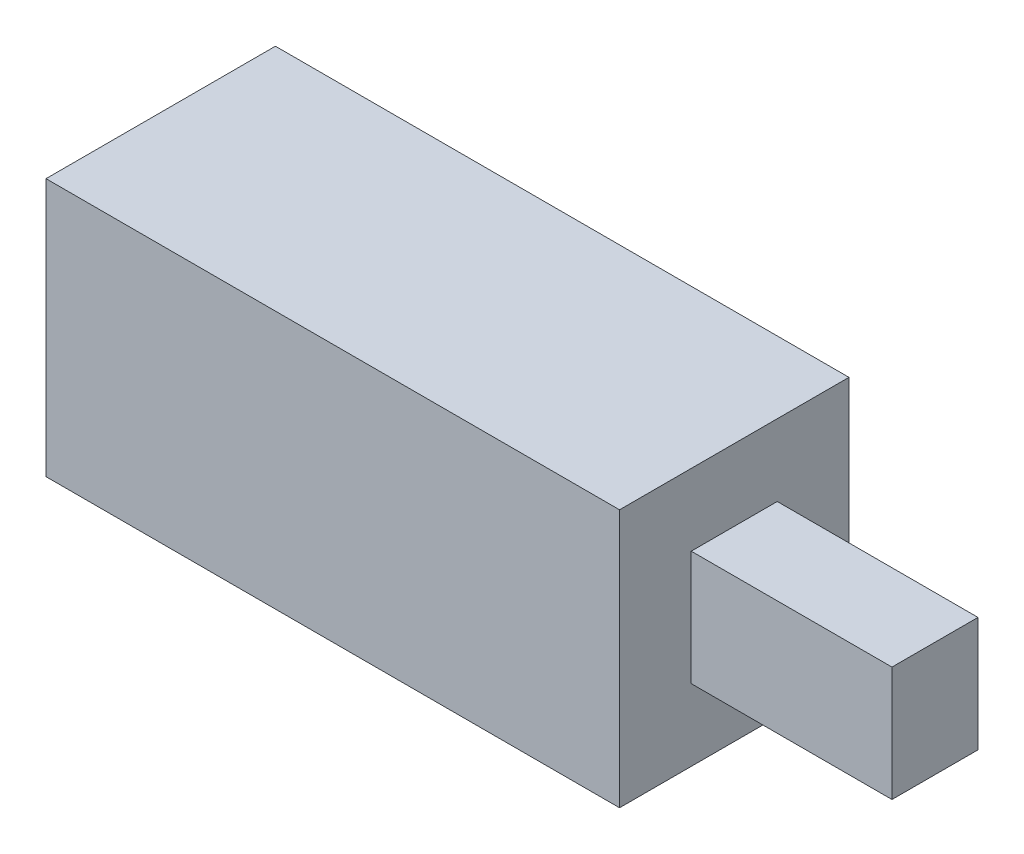
ISO-10303-21;
HEADER;
FILE_DESCRIPTION(('STEP AP214'),'2;1');
FILE_NAME('part.step','',(''),(''),'','','');
FILE_SCHEMA(('AUTOMOTIVE_DESIGN { 1 0 10303 214 1 1 1 1 }'));
ENDSEC;
DATA;
#1=APPLICATION_CONTEXT('core data for automotive mechanical design processes');
#2=APPLICATION_PROTOCOL_DEFINITION('international standard','automotive_design',2000,#1);
#3=PRODUCT_CONTEXT('',#1,'mechanical');
#4=PRODUCT('Part','Part','',(#3));
#5=PRODUCT_RELATED_PRODUCT_CATEGORY('part','',(#4));
#6=PRODUCT_DEFINITION_FORMATION('','',#4);
#7=PRODUCT_DEFINITION_CONTEXT('part definition',#1,'design');
#8=PRODUCT_DEFINITION('design','',#6,#7);
#9=PRODUCT_DEFINITION_SHAPE('','',#8);
#10=(LENGTH_UNIT() NAMED_UNIT(*) SI_UNIT(.MILLI.,.METRE.));
#11=(NAMED_UNIT(*) PLANE_ANGLE_UNIT() SI_UNIT($,.RADIAN.));
#12=(NAMED_UNIT(*) SI_UNIT($,.STERADIAN.) SOLID_ANGLE_UNIT());
#13=UNCERTAINTY_MEASURE_WITH_UNIT(LENGTH_MEASURE(1.E-05),#10,'distance_accuracy_value','');
#14=(GEOMETRIC_REPRESENTATION_CONTEXT(3) GLOBAL_UNCERTAINTY_ASSIGNED_CONTEXT((#13)) GLOBAL_UNIT_ASSIGNED_CONTEXT((#10,
#11,#12)) REPRESENTATION_CONTEXT('',''));
#15=CARTESIAN_POINT('',(0.,0.,0.));
#16=DIRECTION('',(0.,0.,1.));
#17=DIRECTION('',(1.,0.,0.));
#18=AXIS2_PLACEMENT_3D('',#15,#16,#17);
#19=CARTESIAN_POINT('',(10.,-4.5,8.));
#20=DIRECTION('',(-1.,0.,0.));
#21=DIRECTION('',(0.,-1.,0.));
#22=AXIS2_PLACEMENT_3D('',#19,#20,#21);
#23=PLANE('',#22);
#24=DIRECTION('',(0.,1.,0.));
#25=VECTOR('',#24,1.);
#26=CARTESIAN_POINT('',(10.,-4.5,0.));
#27=LINE('',#26,#25);
#28=CARTESIAN_POINT('',(10.,-4.5,0.));
#29=VERTEX_POINT('',#28);
#30=CARTESIAN_POINT('',(10.,4.5,0.));
#31=VERTEX_POINT('',#30);
#32=EDGE_CURVE('E195',#29,#31,#27,.T.);
#33=ORIENTED_EDGE('',*,*,#32,.T.);
#34=DIRECTION('',(0.,0.,-1.));
#35=VECTOR('',#34,1.);
#36=CARTESIAN_POINT('',(10.,4.5,8.));
#37=LINE('',#36,#35);
#38=CARTESIAN_POINT('',(10.,4.5,8.));
#39=VERTEX_POINT('',#38);
#40=EDGE_CURVE('E200',#39,#31,#37,.T.);
#41=ORIENTED_EDGE('',*,*,#40,.F.);
#42=DIRECTION('',(0.,1.,0.));
#43=VECTOR('',#42,1.);
#44=CARTESIAN_POINT('',(10.,-4.5,8.));
#45=LINE('',#44,#43);
#46=CARTESIAN_POINT('',(10.,-4.5,8.));
#47=VERTEX_POINT('',#46);
#48=EDGE_CURVE('E186',#47,#39,#45,.T.);
#49=ORIENTED_EDGE('',*,*,#48,.F.);
#50=DIRECTION('',(0.,0.,-1.));
#51=VECTOR('',#50,1.);
#52=CARTESIAN_POINT('',(10.,-4.5,8.));
#53=LINE('',#52,#51);
#54=EDGE_CURVE('E41',#47,#29,#53,.T.);
#55=ORIENTED_EDGE('',*,*,#54,.T.);
#56=EDGE_LOOP('',(#33,#41,#49,#55));
#57=FACE_BOUND('',#56,.T.);
#58=DIRECTION('',(0.,1.,0.));
#59=VECTOR('',#58,1.);
#60=CARTESIAN_POINT('',(10.,-2.,2.5));
#61=LINE('',#60,#59);
#62=CARTESIAN_POINT('',(10.,-2.,2.5));
#63=VERTEX_POINT('',#62);
#64=CARTESIAN_POINT('',(10.,2.,2.5));
#65=VERTEX_POINT('',#64);
#66=EDGE_CURVE('E48',#63,#65,#61,.T.);
#67=ORIENTED_EDGE('',*,*,#66,.F.);
#68=DIRECTION('',(0.,0.,-1.));
#69=VECTOR('',#68,1.);
#70=CARTESIAN_POINT('',(10.,-2.,5.5));
#71=LINE('',#70,#69);
#72=CARTESIAN_POINT('',(10.,-2.,5.5));
#73=VERTEX_POINT('',#72);
#74=EDGE_CURVE('E52',#73,#63,#71,.T.);
#75=ORIENTED_EDGE('',*,*,#74,.F.);
#76=DIRECTION('',(0.,-1.,0.));
#77=VECTOR('',#76,1.);
#78=CARTESIAN_POINT('',(10.,-2.,5.5));
#79=LINE('',#78,#77);
#80=CARTESIAN_POINT('',(10.,2.,5.5));
#81=VERTEX_POINT('',#80);
#82=EDGE_CURVE('E367',#81,#73,#79,.T.);
#83=ORIENTED_EDGE('',*,*,#82,.F.);
#84=DIRECTION('',(0.,0.,1.));
#85=VECTOR('',#84,1.);
#86=CARTESIAN_POINT('',(10.,2.,5.5));
#87=LINE('',#86,#85);
#88=EDGE_CURVE('E373',#65,#81,#87,.T.);
#89=ORIENTED_EDGE('',*,*,#88,.F.);
#90=EDGE_LOOP('',(#67,#75,#83,#89));
#91=FACE_BOUND('',#90,.T.);
#92=ADVANCED_FACE('F33',(#57,#91),#23,.F.);
#93=CARTESIAN_POINT('',(-10.,-4.5,8.));
#94=DIRECTION('',(1.,0.,0.));
#95=DIRECTION('',(0.,1.,0.));
#96=AXIS2_PLACEMENT_3D('',#93,#94,#95);
#97=PLANE('',#96);
#98=DIRECTION('',(0.,0.,-1.));
#99=VECTOR('',#98,1.);
#100=CARTESIAN_POINT('',(-10.,2.5,2.));
#101=LINE('',#100,#99);
#102=CARTESIAN_POINT('',(-10.,2.5,6.));
#103=VERTEX_POINT('',#102);
#104=CARTESIAN_POINT('',(-10.,2.5,2.));
#105=VERTEX_POINT('',#104);
#106=EDGE_CURVE('E144',#103,#105,#101,.T.);
#107=ORIENTED_EDGE('',*,*,#106,.F.);
#108=DIRECTION('',(0.,1.,0.));
#109=VECTOR('',#108,1.);
#110=CARTESIAN_POINT('',(-10.,-2.5,6.));
#111=LINE('',#110,#109);
#112=CARTESIAN_POINT('',(-10.,-2.5,6.));
#113=VERTEX_POINT('',#112);
#114=EDGE_CURVE('E142',#113,#103,#111,.T.);
#115=ORIENTED_EDGE('',*,*,#114,.F.);
#116=DIRECTION('',(0.,0.,1.));
#117=VECTOR('',#116,1.);
#118=CARTESIAN_POINT('',(-10.,-2.5,2.));
#119=LINE('',#118,#117);
#120=CARTESIAN_POINT('',(-10.,-2.5,2.));
#121=VERTEX_POINT('',#120);
#122=EDGE_CURVE('E154',#121,#113,#119,.T.);
#123=ORIENTED_EDGE('',*,*,#122,.F.);
#124=DIRECTION('',(0.,-1.,0.));
#125=VECTOR('',#124,1.);
#126=CARTESIAN_POINT('',(-10.,-2.5,2.));
#127=LINE('',#126,#125);
#128=EDGE_CURVE('E166',#105,#121,#127,.T.);
#129=ORIENTED_EDGE('',*,*,#128,.F.);
#130=EDGE_LOOP('',(#107,#115,#123,#129));
#131=FACE_BOUND('',#130,.T.);
#132=DIRECTION('',(0.,-1.,0.));
#133=VECTOR('',#132,1.);
#134=CARTESIAN_POINT('',(-10.,-4.5,0.));
#135=LINE('',#134,#133);
#136=CARTESIAN_POINT('',(-10.,4.5,0.));
#137=VERTEX_POINT('',#136);
#138=CARTESIAN_POINT('',(-10.,-4.5,0.));
#139=VERTEX_POINT('',#138);
#140=EDGE_CURVE('E173',#137,#139,#135,.T.);
#141=ORIENTED_EDGE('',*,*,#140,.T.);
#142=DIRECTION('',(0.,0.,-1.));
#143=VECTOR('',#142,1.);
#144=CARTESIAN_POINT('',(-10.,-4.5,8.));
#145=LINE('',#144,#143);
#146=CARTESIAN_POINT('',(-10.,-4.5,8.));
#147=VERTEX_POINT('',#146);
#148=EDGE_CURVE('E11',#147,#139,#145,.T.);
#149=ORIENTED_EDGE('',*,*,#148,.F.);
#150=DIRECTION('',(0.,-1.,0.));
#151=VECTOR('',#150,1.);
#152=CARTESIAN_POINT('',(-10.,-4.5,8.));
#153=LINE('',#152,#151);
#154=CARTESIAN_POINT('',(-10.,4.5,8.));
#155=VERTEX_POINT('',#154);
#156=EDGE_CURVE('E180',#155,#147,#153,.T.);
#157=ORIENTED_EDGE('',*,*,#156,.F.);
#158=DIRECTION('',(0.,0.,-1.));
#159=VECTOR('',#158,1.);
#160=CARTESIAN_POINT('',(-10.,4.5,8.));
#161=LINE('',#160,#159);
#162=EDGE_CURVE('E190',#155,#137,#161,.T.);
#163=ORIENTED_EDGE('',*,*,#162,.T.);
#164=EDGE_LOOP('',(#141,#149,#157,#163));
#165=FACE_BOUND('',#164,.T.);
#166=ADVANCED_FACE('F35',(#131,#165),#97,.F.);
#167=CARTESIAN_POINT('',(10.,-4.5,8.));
#168=DIRECTION('',(0.,1.,0.));
#169=DIRECTION('',(-1.,0.,0.));
#170=AXIS2_PLACEMENT_3D('',#167,#168,#169);
#171=PLANE('',#170);
#172=DIRECTION('',(1.,0.,0.));
#173=VECTOR('',#172,1.);
#174=CARTESIAN_POINT('',(10.,-4.5,0.));
#175=LINE('',#174,#173);
#176=EDGE_CURVE('E193',#139,#29,#175,.T.);
#177=ORIENTED_EDGE('',*,*,#176,.T.);
#178=ORIENTED_EDGE('',*,*,#54,.F.);
#179=DIRECTION('',(1.,0.,0.));
#180=VECTOR('',#179,1.);
#181=CARTESIAN_POINT('',(10.,-4.5,8.));
#182=LINE('',#181,#180);
#183=EDGE_CURVE('E183',#147,#47,#182,.T.);
#184=ORIENTED_EDGE('',*,*,#183,.F.);
#185=ORIENTED_EDGE('',*,*,#148,.T.);
#186=EDGE_LOOP('',(#177,#178,#184,#185));
#187=FACE_BOUND('',#186,.T.);
#188=ADVANCED_FACE('F222',(#187),#171,.F.);
#189=CARTESIAN_POINT('',(10.,4.5,8.));
#190=DIRECTION('',(0.,-1.,0.));
#191=DIRECTION('',(1.,0.,0.));
#192=AXIS2_PLACEMENT_3D('',#189,#190,#191);
#193=PLANE('',#192);
#194=DIRECTION('',(-1.,0.,0.));
#195=VECTOR('',#194,1.);
#196=CARTESIAN_POINT('',(10.,4.5,0.));
#197=LINE('',#196,#195);
#198=EDGE_CURVE('E184',#31,#137,#197,.T.);
#199=ORIENTED_EDGE('',*,*,#198,.T.);
#200=ORIENTED_EDGE('',*,*,#162,.F.);
#201=DIRECTION('',(-1.,0.,0.));
#202=VECTOR('',#201,1.);
#203=CARTESIAN_POINT('',(10.,4.5,8.));
#204=LINE('',#203,#202);
#205=EDGE_CURVE('E188',#39,#155,#204,.T.);
#206=ORIENTED_EDGE('',*,*,#205,.F.);
#207=ORIENTED_EDGE('',*,*,#40,.T.);
#208=EDGE_LOOP('',(#199,#200,#206,#207));
#209=FACE_BOUND('',#208,.T.);
#210=ADVANCED_FACE('F215',(#209),#193,.F.);
#211=CARTESIAN_POINT('',(0.,0.,8.));
#212=DIRECTION('',(0.,0.,1.));
#213=DIRECTION('',(1.,0.,0.));
#214=AXIS2_PLACEMENT_3D('',#211,#212,#213);
#215=PLANE('',#214);
#216=ORIENTED_EDGE('',*,*,#156,.T.);
#217=ORIENTED_EDGE('',*,*,#183,.T.);
#218=ORIENTED_EDGE('',*,*,#48,.T.);
#219=ORIENTED_EDGE('',*,*,#205,.T.);
#220=EDGE_LOOP('',(#216,#217,#218,#219));
#221=FACE_BOUND('',#220,.T.);
#222=ADVANCED_FACE('F221',(#221),#215,.T.);
#223=CARTESIAN_POINT('',(0.,0.,0.));
#224=DIRECTION('',(0.,0.,1.));
#225=DIRECTION('',(1.,0.,0.));
#226=AXIS2_PLACEMENT_3D('',#223,#224,#225);
#227=PLANE('',#226);
#228=ORIENTED_EDGE('',*,*,#140,.F.);
#229=ORIENTED_EDGE('',*,*,#198,.F.);
#230=ORIENTED_EDGE('',*,*,#32,.F.);
#231=ORIENTED_EDGE('',*,*,#176,.F.);
#232=EDGE_LOOP('',(#228,#229,#230,#231));
#233=FACE_BOUND('',#232,.T.);
#234=ADVANCED_FACE('F212',(#233),#227,.F.);
#235=CARTESIAN_POINT('',(0.,-2.5,6.));
#236=DIRECTION('',(0.,0.,1.));
#237=DIRECTION('',(1.,0.,0.));
#238=AXIS2_PLACEMENT_3D('',#235,#236,#237);
#239=PLANE('',#238);
#240=ORIENTED_EDGE('',*,*,#114,.T.);
#241=DIRECTION('',(-1.,0.,0.));
#242=VECTOR('',#241,1.);
#243=CARTESIAN_POINT('',(0.,2.5,6.));
#244=LINE('',#243,#242);
#245=CARTESIAN_POINT('',(0.,2.5,6.));
#246=VERTEX_POINT('',#245);
#247=EDGE_CURVE('E162',#246,#103,#244,.T.);
#248=ORIENTED_EDGE('',*,*,#247,.F.);
#249=DIRECTION('',(0.,1.,0.));
#250=VECTOR('',#249,1.);
#251=CARTESIAN_POINT('',(0.,-2.5,6.));
#252=LINE('',#251,#250);
#253=CARTESIAN_POINT('',(0.,-2.5,6.));
#254=VERTEX_POINT('',#253);
#255=EDGE_CURVE('E150',#254,#246,#252,.T.);
#256=ORIENTED_EDGE('',*,*,#255,.F.);
#257=DIRECTION('',(-1.,0.,0.));
#258=VECTOR('',#257,1.);
#259=CARTESIAN_POINT('',(0.,-2.5,6.));
#260=LINE('',#259,#258);
#261=EDGE_CURVE('E171',#254,#113,#260,.T.);
#262=ORIENTED_EDGE('',*,*,#261,.T.);
#263=EDGE_LOOP('',(#240,#248,#256,#262));
#264=FACE_BOUND('',#263,.T.);
#265=ADVANCED_FACE('F237',(#264),#239,.F.);
#266=CARTESIAN_POINT('',(0.,-2.5,2.));
#267=DIRECTION('',(0.,-1.,0.));
#268=DIRECTION('',(0.,0.,-1.));
#269=AXIS2_PLACEMENT_3D('',#266,#267,#268);
#270=PLANE('',#269);
#271=ORIENTED_EDGE('',*,*,#122,.T.);
#272=ORIENTED_EDGE('',*,*,#261,.F.);
#273=DIRECTION('',(0.,0.,1.));
#274=VECTOR('',#273,1.);
#275=CARTESIAN_POINT('',(0.,-2.5,2.));
#276=LINE('',#275,#274);
#277=CARTESIAN_POINT('',(0.,-2.5,2.));
#278=VERTEX_POINT('',#277);
#279=EDGE_CURVE('E160',#278,#254,#276,.T.);
#280=ORIENTED_EDGE('',*,*,#279,.F.);
#281=DIRECTION('',(-1.,0.,0.));
#282=VECTOR('',#281,1.);
#283=CARTESIAN_POINT('',(0.,-2.5,2.));
#284=LINE('',#283,#282);
#285=EDGE_CURVE('E174',#278,#121,#284,.T.);
#286=ORIENTED_EDGE('',*,*,#285,.T.);
#287=EDGE_LOOP('',(#271,#272,#280,#286));
#288=FACE_BOUND('',#287,.T.);
#289=ADVANCED_FACE('F242',(#288),#270,.F.);
#290=CARTESIAN_POINT('',(0.,-2.5,2.));
#291=DIRECTION('',(0.,0.,-1.));
#292=DIRECTION('',(0.,1.,0.));
#293=AXIS2_PLACEMENT_3D('',#290,#291,#292);
#294=PLANE('',#293);
#295=ORIENTED_EDGE('',*,*,#128,.T.);
#296=ORIENTED_EDGE('',*,*,#285,.F.);
#297=DIRECTION('',(0.,-1.,0.));
#298=VECTOR('',#297,1.);
#299=CARTESIAN_POINT('',(0.,-2.5,2.));
#300=LINE('',#299,#298);
#301=CARTESIAN_POINT('',(0.,2.5,2.));
#302=VERTEX_POINT('',#301);
#303=EDGE_CURVE('E157',#302,#278,#300,.T.);
#304=ORIENTED_EDGE('',*,*,#303,.F.);
#305=DIRECTION('',(-1.,0.,0.));
#306=VECTOR('',#305,1.);
#307=CARTESIAN_POINT('',(0.,2.5,2.));
#308=LINE('',#307,#306);
#309=EDGE_CURVE('E176',#302,#105,#308,.T.);
#310=ORIENTED_EDGE('',*,*,#309,.T.);
#311=EDGE_LOOP('',(#295,#296,#304,#310));
#312=FACE_BOUND('',#311,.T.);
#313=ADVANCED_FACE('F248',(#312),#294,.F.);
#314=CARTESIAN_POINT('',(0.,2.5,2.));
#315=DIRECTION('',(0.,1.,0.));
#316=DIRECTION('',(-1.,0.,0.));
#317=AXIS2_PLACEMENT_3D('',#314,#315,#316);
#318=PLANE('',#317);
#319=ORIENTED_EDGE('',*,*,#106,.T.);
#320=ORIENTED_EDGE('',*,*,#309,.F.);
#321=DIRECTION('',(0.,0.,-1.));
#322=VECTOR('',#321,1.);
#323=CARTESIAN_POINT('',(0.,2.5,2.));
#324=LINE('',#323,#322);
#325=EDGE_CURVE('E153',#246,#302,#324,.T.);
#326=ORIENTED_EDGE('',*,*,#325,.F.);
#327=ORIENTED_EDGE('',*,*,#247,.T.);
#328=EDGE_LOOP('',(#319,#320,#326,#327));
#329=FACE_BOUND('',#328,.T.);
#330=ADVANCED_FACE('F244',(#329),#318,.F.);
#331=CARTESIAN_POINT('',(0.,0.,0.));
#332=DIRECTION('',(1.,0.,0.));
#333=DIRECTION('',(0.,0.,-1.));
#334=AXIS2_PLACEMENT_3D('',#331,#332,#333);
#335=PLANE('',#334);
#336=ORIENTED_EDGE('',*,*,#255,.T.);
#337=ORIENTED_EDGE('',*,*,#325,.T.);
#338=ORIENTED_EDGE('',*,*,#303,.T.);
#339=ORIENTED_EDGE('',*,*,#279,.T.);
#340=EDGE_LOOP('',(#336,#337,#338,#339));
#341=FACE_BOUND('',#340,.T.);
#342=ADVANCED_FACE('F247',(#341),#335,.F.);
#343=CARTESIAN_POINT('',(17.,-2.,2.5));
#344=DIRECTION('',(0.,0.,1.));
#345=DIRECTION('',(0.,-1.,0.));
#346=AXIS2_PLACEMENT_3D('',#343,#344,#345);
#347=PLANE('',#346);
#348=ORIENTED_EDGE('',*,*,#66,.T.);
#349=DIRECTION('',(-1.,0.,0.));
#350=VECTOR('',#349,1.);
#351=CARTESIAN_POINT('',(17.,2.,2.5));
#352=LINE('',#351,#350);
#353=CARTESIAN_POINT('',(17.,2.,2.5));
#354=VERTEX_POINT('',#353);
#355=EDGE_CURVE('E125',#354,#65,#352,.T.);
#356=ORIENTED_EDGE('',*,*,#355,.F.);
#357=DIRECTION('',(0.,1.,0.));
#358=VECTOR('',#357,1.);
#359=CARTESIAN_POINT('',(17.,-2.,2.5));
#360=LINE('',#359,#358);
#361=CARTESIAN_POINT('',(17.,-2.,2.5));
#362=VERTEX_POINT('',#361);
#363=EDGE_CURVE('E131',#362,#354,#360,.T.);
#364=ORIENTED_EDGE('',*,*,#363,.F.);
#365=DIRECTION('',(-1.,0.,0.));
#366=VECTOR('',#365,1.);
#367=CARTESIAN_POINT('',(17.,-2.,2.5));
#368=LINE('',#367,#366);
#369=EDGE_CURVE('E365',#362,#63,#368,.T.);
#370=ORIENTED_EDGE('',*,*,#369,.T.);
#371=EDGE_LOOP('',(#348,#356,#364,#370));
#372=FACE_BOUND('',#371,.T.);
#373=ADVANCED_FACE('F141',(#372),#347,.F.);
#374=CARTESIAN_POINT('',(17.,2.,5.5));
#375=DIRECTION('',(0.,-1.,0.));
#376=DIRECTION('',(1.,0.,0.));
#377=AXIS2_PLACEMENT_3D('',#374,#375,#376);
#378=PLANE('',#377);
#379=ORIENTED_EDGE('',*,*,#88,.T.);
#380=DIRECTION('',(-1.,0.,0.));
#381=VECTOR('',#380,1.);
#382=CARTESIAN_POINT('',(17.,2.,5.5));
#383=LINE('',#382,#381);
#384=CARTESIAN_POINT('',(17.,2.,5.5));
#385=VERTEX_POINT('',#384);
#386=EDGE_CURVE('E127',#385,#81,#383,.T.);
#387=ORIENTED_EDGE('',*,*,#386,.F.);
#388=DIRECTION('',(0.,0.,1.));
#389=VECTOR('',#388,1.);
#390=CARTESIAN_POINT('',(17.,2.,5.5));
#391=LINE('',#390,#389);
#392=EDGE_CURVE('E120',#354,#385,#391,.T.);
#393=ORIENTED_EDGE('',*,*,#392,.F.);
#394=ORIENTED_EDGE('',*,*,#355,.T.);
#395=EDGE_LOOP('',(#379,#387,#393,#394));
#396=FACE_BOUND('',#395,.T.);
#397=ADVANCED_FACE('F123',(#396),#378,.F.);
#398=CARTESIAN_POINT('',(17.,-2.,5.5));
#399=DIRECTION('',(0.,0.,-1.));
#400=DIRECTION('',(-1.,0.,0.));
#401=AXIS2_PLACEMENT_3D('',#398,#399,#400);
#402=PLANE('',#401);
#403=ORIENTED_EDGE('',*,*,#82,.T.);
#404=DIRECTION('',(-1.,0.,0.));
#405=VECTOR('',#404,1.);
#406=CARTESIAN_POINT('',(17.,-2.,5.5));
#407=LINE('',#406,#405);
#408=CARTESIAN_POINT('',(17.,-2.,5.5));
#409=VERTEX_POINT('',#408);
#410=EDGE_CURVE('E146',#409,#73,#407,.T.);
#411=ORIENTED_EDGE('',*,*,#410,.F.);
#412=DIRECTION('',(0.,-1.,0.));
#413=VECTOR('',#412,1.);
#414=CARTESIAN_POINT('',(17.,-2.,5.5));
#415=LINE('',#414,#413);
#416=EDGE_CURVE('E130',#385,#409,#415,.T.);
#417=ORIENTED_EDGE('',*,*,#416,.F.);
#418=ORIENTED_EDGE('',*,*,#386,.T.);
#419=EDGE_LOOP('',(#403,#411,#417,#418));
#420=FACE_BOUND('',#419,.T.);
#421=ADVANCED_FACE('F263',(#420),#402,.F.);
#422=CARTESIAN_POINT('',(17.,-2.,5.5));
#423=DIRECTION('',(0.,1.,0.));
#424=DIRECTION('',(-1.,0.,0.));
#425=AXIS2_PLACEMENT_3D('',#422,#423,#424);
#426=PLANE('',#425);
#427=ORIENTED_EDGE('',*,*,#74,.T.);
#428=ORIENTED_EDGE('',*,*,#369,.F.);
#429=DIRECTION('',(0.,0.,-1.));
#430=VECTOR('',#429,1.);
#431=CARTESIAN_POINT('',(17.,-2.,5.5));
#432=LINE('',#431,#430);
#433=EDGE_CURVE('E136',#409,#362,#432,.T.);
#434=ORIENTED_EDGE('',*,*,#433,.F.);
#435=ORIENTED_EDGE('',*,*,#410,.T.);
#436=EDGE_LOOP('',(#427,#428,#434,#435));
#437=FACE_BOUND('',#436,.T.);
#438=ADVANCED_FACE('F266',(#437),#426,.F.);
#439=CARTESIAN_POINT('',(17.,0.,0.));
#440=DIRECTION('',(-1.,0.,0.));
#441=DIRECTION('',(0.,0.,1.));
#442=AXIS2_PLACEMENT_3D('',#439,#440,#441);
#443=PLANE('',#442);
#444=ORIENTED_EDGE('',*,*,#363,.T.);
#445=ORIENTED_EDGE('',*,*,#392,.T.);
#446=ORIENTED_EDGE('',*,*,#416,.T.);
#447=ORIENTED_EDGE('',*,*,#433,.T.);
#448=EDGE_LOOP('',(#444,#445,#446,#447));
#449=FACE_BOUND('',#448,.T.);
#450=ADVANCED_FACE('F134',(#449),#443,.F.);
#451=CLOSED_SHELL('',(#92,#166,#188,#210,#222,#234,#265,#289,#313,#330,#342,#373,#397,#421,#438,#450));
#452=MANIFOLD_SOLID_BREP('B2',#451);
#453=ADVANCED_BREP_SHAPE_REPRESENTATION('',(#18,#452),#14);
#454=SHAPE_DEFINITION_REPRESENTATION(#9,#453);
ENDSEC;
END-ISO-10303-21;
